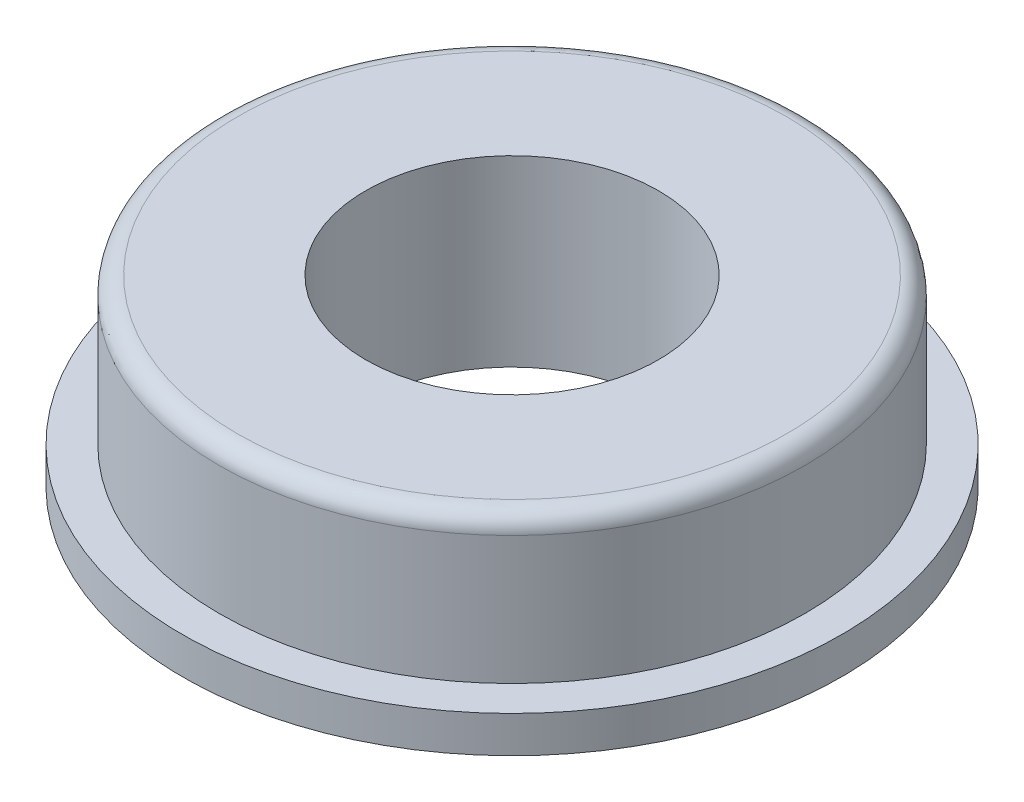
ISO-10303-21;
HEADER;
FILE_DESCRIPTION(('STEP AP214'),'2;1');
FILE_NAME('part.step','',(''),(''),'','','');
FILE_SCHEMA(('AUTOMOTIVE_DESIGN { 1 0 10303 214 1 1 1 1 }'));
ENDSEC;
DATA;
#1=APPLICATION_CONTEXT('core data for automotive mechanical design processes');
#2=APPLICATION_PROTOCOL_DEFINITION('international standard','automotive_design',2000,#1);
#3=PRODUCT_CONTEXT('',#1,'mechanical');
#4=PRODUCT('Part','Part','',(#3));
#5=PRODUCT_RELATED_PRODUCT_CATEGORY('part','',(#4));
#6=PRODUCT_DEFINITION_FORMATION('','',#4);
#7=PRODUCT_DEFINITION_CONTEXT('part definition',#1,'design');
#8=PRODUCT_DEFINITION('design','',#6,#7);
#9=PRODUCT_DEFINITION_SHAPE('','',#8);
#10=(LENGTH_UNIT() NAMED_UNIT(*) SI_UNIT(.MILLI.,.METRE.));
#11=(NAMED_UNIT(*) PLANE_ANGLE_UNIT() SI_UNIT($,.RADIAN.));
#12=(NAMED_UNIT(*) SI_UNIT($,.STERADIAN.) SOLID_ANGLE_UNIT());
#13=UNCERTAINTY_MEASURE_WITH_UNIT(LENGTH_MEASURE(1.E-05),#10,'distance_accuracy_value','');
#14=(GEOMETRIC_REPRESENTATION_CONTEXT(3) GLOBAL_UNCERTAINTY_ASSIGNED_CONTEXT((#13)) GLOBAL_UNIT_ASSIGNED_CONTEXT((#10,
#11,#12)) REPRESENTATION_CONTEXT('',''));
#15=CARTESIAN_POINT('',(0.,0.,0.));
#16=DIRECTION('',(0.,0.,1.));
#17=DIRECTION('',(1.,0.,0.));
#18=AXIS2_PLACEMENT_3D('',#15,#16,#17);
#19=CARTESIAN_POINT('',(0.,4.5,0.));
#20=DIRECTION('',(0.,1.,0.));
#21=DIRECTION('',(0.,0.,1.));
#22=AXIS2_PLACEMENT_3D('',#19,#20,#21);
#23=TOROIDAL_SURFACE('',#22,7.5,0.5);
#24=CARTESIAN_POINT('',(0.,4.5,0.));
#25=DIRECTION('',(0.,-1.,0.));
#26=DIRECTION('',(0.,0.,-1.));
#27=AXIS2_PLACEMENT_3D('',#24,#25,#26);
#28=CIRCLE('',#27,8.);
#29=CARTESIAN_POINT('',(0.,4.5,-8.));
#30=VERTEX_POINT('',#29);
#31=EDGE_CURVE('E46',#30,#30,#28,.T.);
#32=ORIENTED_EDGE('',*,*,#31,.F.);
#33=EDGE_LOOP('',(#32));
#34=FACE_BOUND('',#33,.T.);
#35=CARTESIAN_POINT('',(0.,5.,0.));
#36=DIRECTION('',(0.,-1.,0.));
#37=DIRECTION('',(0.,0.,1.));
#38=AXIS2_PLACEMENT_3D('',#35,#36,#37);
#39=CIRCLE('',#38,7.5);
#40=CARTESIAN_POINT('',(0.,5.,-7.5));
#41=VERTEX_POINT('',#40);
#42=CARTESIAN_POINT('',(0.,5.,7.5));
#43=VERTEX_POINT('',#42);
#44=EDGE_CURVE('E38',#41,#43,#39,.F.);
#45=ORIENTED_EDGE('',*,*,#44,.F.);
#46=CARTESIAN_POINT('',(0.,5.,0.));
#47=DIRECTION('',(0.,-1.,0.));
#48=DIRECTION('',(0.,0.,-1.));
#49=AXIS2_PLACEMENT_3D('',#46,#47,#48);
#50=CIRCLE('',#49,7.5);
#51=EDGE_CURVE('E35',#43,#41,#50,.F.);
#52=ORIENTED_EDGE('',*,*,#51,.F.);
#53=EDGE_LOOP('',(#45,#52));
#54=FACE_BOUND('',#53,.T.);
#55=ADVANCED_FACE('F17',(#34,#54),#23,.T.);
#56=CARTESIAN_POINT('',(0.,5.,0.));
#57=DIRECTION('',(0.,-1.,0.));
#58=DIRECTION('',(0.,0.,-1.));
#59=AXIS2_PLACEMENT_3D('',#56,#57,#58);
#60=CYLINDRICAL_SURFACE('',#59,8.);
#61=CARTESIAN_POINT('',(0.,1.,0.));
#62=DIRECTION('',(0.,-1.,0.));
#63=DIRECTION('',(0.,0.,-1.));
#64=AXIS2_PLACEMENT_3D('',#61,#62,#63);
#65=CIRCLE('',#64,8.);
#66=CARTESIAN_POINT('',(0.,1.,-8.));
#67=VERTEX_POINT('',#66);
#68=EDGE_CURVE('E43',#67,#67,#65,.F.);
#69=ORIENTED_EDGE('',*,*,#68,.T.);
#70=EDGE_LOOP('',(#69));
#71=FACE_BOUND('',#70,.T.);
#72=ORIENTED_EDGE('',*,*,#31,.T.);
#73=EDGE_LOOP('',(#72));
#74=FACE_BOUND('',#73,.T.);
#75=ADVANCED_FACE('F80',(#71,#74),#60,.T.);
#76=CARTESIAN_POINT('',(0.,5.,0.));
#77=DIRECTION('',(0.,1.,0.));
#78=DIRECTION('',(0.,0.,1.));
#79=AXIS2_PLACEMENT_3D('',#76,#77,#78);
#80=PLANE('',#79);
#81=CARTESIAN_POINT('',(0.,5.,0.));
#82=DIRECTION('',(0.,-1.,0.));
#83=DIRECTION('',(0.,0.,-1.));
#84=AXIS2_PLACEMENT_3D('',#81,#82,#83);
#85=CIRCLE('',#84,4.);
#86=CARTESIAN_POINT('',(0.,5.,-4.));
#87=VERTEX_POINT('',#86);
#88=EDGE_CURVE('E50',#87,#87,#85,.T.);
#89=ORIENTED_EDGE('',*,*,#88,.T.);
#90=EDGE_LOOP('',(#89));
#91=FACE_BOUND('',#90,.T.);
#92=ORIENTED_EDGE('',*,*,#51,.T.);
#93=ORIENTED_EDGE('',*,*,#44,.T.);
#94=EDGE_LOOP('',(#92,#93));
#95=FACE_BOUND('',#94,.T.);
#96=ADVANCED_FACE('F40',(#91,#95),#80,.T.);
#97=CARTESIAN_POINT('',(0.,1.,0.));
#98=DIRECTION('',(0.,-1.,0.));
#99=DIRECTION('',(0.,0.,-1.));
#100=AXIS2_PLACEMENT_3D('',#97,#98,#99);
#101=PLANE('',#100);
#102=ORIENTED_EDGE('',*,*,#68,.F.);
#103=EDGE_LOOP('',(#102));
#104=FACE_BOUND('',#103,.T.);
#105=CARTESIAN_POINT('',(0.,1.,0.));
#106=DIRECTION('',(0.,-1.,0.));
#107=DIRECTION('',(0.,0.,-1.));
#108=AXIS2_PLACEMENT_3D('',#105,#106,#107);
#109=CIRCLE('',#108,9.);
#110=CARTESIAN_POINT('',(0.,1.,-9.));
#111=VERTEX_POINT('',#110);
#112=EDGE_CURVE('E53',#111,#111,#109,.T.);
#113=ORIENTED_EDGE('',*,*,#112,.F.);
#114=EDGE_LOOP('',(#113));
#115=FACE_BOUND('',#114,.T.);
#116=ADVANCED_FACE('F79',(#104,#115),#101,.F.);
#117=CARTESIAN_POINT('',(0.,5.,0.));
#118=DIRECTION('',(0.,-1.,0.));
#119=DIRECTION('',(0.,0.,-1.));
#120=AXIS2_PLACEMENT_3D('',#117,#118,#119);
#121=CYLINDRICAL_SURFACE('',#120,4.);
#122=CARTESIAN_POINT('',(0.,0.,0.));
#123=DIRECTION('',(0.,-1.,0.));
#124=DIRECTION('',(0.,0.,-1.));
#125=AXIS2_PLACEMENT_3D('',#122,#123,#124);
#126=CIRCLE('',#125,4.);
#127=CARTESIAN_POINT('',(0.,0.,-4.));
#128=VERTEX_POINT('',#127);
#129=EDGE_CURVE('E28',#128,#128,#126,.T.);
#130=ORIENTED_EDGE('',*,*,#129,.T.);
#131=EDGE_LOOP('',(#130));
#132=FACE_BOUND('',#131,.T.);
#133=ORIENTED_EDGE('',*,*,#88,.F.);
#134=EDGE_LOOP('',(#133));
#135=FACE_BOUND('',#134,.T.);
#136=ADVANCED_FACE('F107',(#132,#135),#121,.F.);
#137=CARTESIAN_POINT('',(0.,1.,0.));
#138=DIRECTION('',(0.,-1.,0.));
#139=DIRECTION('',(0.,0.,-1.));
#140=AXIS2_PLACEMENT_3D('',#137,#138,#139);
#141=CYLINDRICAL_SURFACE('',#140,9.);
#142=CARTESIAN_POINT('',(0.,0.,0.));
#143=DIRECTION('',(0.,-1.,0.));
#144=DIRECTION('',(0.,0.,-1.));
#145=AXIS2_PLACEMENT_3D('',#142,#143,#144);
#146=CIRCLE('',#145,9.);
#147=CARTESIAN_POINT('',(0.,0.,-9.));
#148=VERTEX_POINT('',#147);
#149=EDGE_CURVE('E10',#148,#148,#146,.F.);
#150=ORIENTED_EDGE('',*,*,#149,.T.);
#151=EDGE_LOOP('',(#150));
#152=FACE_BOUND('',#151,.T.);
#153=ORIENTED_EDGE('',*,*,#112,.T.);
#154=EDGE_LOOP('',(#153));
#155=FACE_BOUND('',#154,.T.);
#156=ADVANCED_FACE('F101',(#152,#155),#141,.T.);
#157=CARTESIAN_POINT('',(0.,0.,0.));
#158=DIRECTION('',(0.,1.,0.));
#159=DIRECTION('',(0.,0.,1.));
#160=AXIS2_PLACEMENT_3D('',#157,#158,#159);
#161=PLANE('',#160);
#162=ORIENTED_EDGE('',*,*,#149,.F.);
#163=EDGE_LOOP('',(#162));
#164=FACE_BOUND('',#163,.T.);
#165=ORIENTED_EDGE('',*,*,#129,.F.);
#166=EDGE_LOOP('',(#165));
#167=FACE_BOUND('',#166,.T.);
#168=ADVANCED_FACE('F99',(#164,#167),#161,.F.);
#169=CLOSED_SHELL('',(#55,#75,#96,#116,#136,#156,#168));
#170=MANIFOLD_SOLID_BREP('B1',#169);
#171=ADVANCED_BREP_SHAPE_REPRESENTATION('',(#18,#170),#14);
#172=SHAPE_DEFINITION_REPRESENTATION(#9,#171);
ENDSEC;
END-ISO-10303-21;
